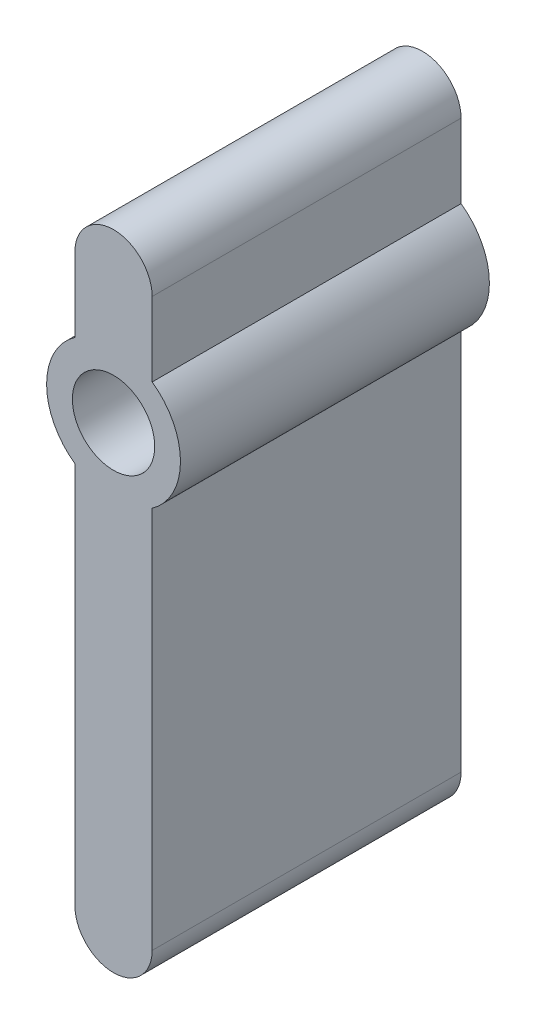
ISO-10303-21;
HEADER;
FILE_DESCRIPTION(('STEP AP214'),'2;1');
FILE_NAME('part.step','',(''),(''),'','','');
FILE_SCHEMA(('AUTOMOTIVE_DESIGN { 1 0 10303 214 1 1 1 1 }'));
ENDSEC;
DATA;
#1=APPLICATION_CONTEXT('core data for automotive mechanical design processes');
#2=APPLICATION_PROTOCOL_DEFINITION('international standard','automotive_design',2000,#1);
#3=PRODUCT_CONTEXT('',#1,'mechanical');
#4=PRODUCT('Part','Part','',(#3));
#5=PRODUCT_RELATED_PRODUCT_CATEGORY('part','',(#4));
#6=PRODUCT_DEFINITION_FORMATION('','',#4);
#7=PRODUCT_DEFINITION_CONTEXT('part definition',#1,'design');
#8=PRODUCT_DEFINITION('design','',#6,#7);
#9=PRODUCT_DEFINITION_SHAPE('','',#8);
#10=(LENGTH_UNIT() NAMED_UNIT(*) SI_UNIT(.MILLI.,.METRE.));
#11=(NAMED_UNIT(*) PLANE_ANGLE_UNIT() SI_UNIT($,.RADIAN.));
#12=(NAMED_UNIT(*) SI_UNIT($,.STERADIAN.) SOLID_ANGLE_UNIT());
#13=UNCERTAINTY_MEASURE_WITH_UNIT(LENGTH_MEASURE(1.E-05),#10,'distance_accuracy_value','');
#14=(GEOMETRIC_REPRESENTATION_CONTEXT(3) GLOBAL_UNCERTAINTY_ASSIGNED_CONTEXT((#13)) GLOBAL_UNIT_ASSIGNED_CONTEXT((#10,
#11,#12)) REPRESENTATION_CONTEXT('',''));
#15=CARTESIAN_POINT('',(0.,0.,0.));
#16=DIRECTION('',(0.,0.,1.));
#17=DIRECTION('',(1.,0.,0.));
#18=AXIS2_PLACEMENT_3D('',#15,#16,#17);
#19=CARTESIAN_POINT('',(1.5,0.,12.));
#20=DIRECTION('',(1.,0.,0.));
#21=DIRECTION('',(0.,1.,0.));
#22=AXIS2_PLACEMENT_3D('',#19,#20,#21);
#23=PLANE('',#22);
#24=DIRECTION('',(0.,-1.,0.));
#25=VECTOR('',#24,1.);
#26=CARTESIAN_POINT('',(1.5,0.,0.));
#27=LINE('',#26,#25);
#28=CARTESIAN_POINT('',(1.5,-2.12367605815953,0.));
#29=VERTEX_POINT('',#28);
#30=CARTESIAN_POINT('',(1.5,-17.,0.));
#31=VERTEX_POINT('',#30);
#32=EDGE_CURVE('E152',#29,#31,#27,.T.);
#33=ORIENTED_EDGE('',*,*,#32,.F.);
#34=DIRECTION('',(0.,0.,-1.));
#35=VECTOR('',#34,1.);
#36=CARTESIAN_POINT('',(1.5,-2.12367605815953,12.));
#37=LINE('',#36,#35);
#38=CARTESIAN_POINT('',(1.5,-2.12367605815953,12.));
#39=VERTEX_POINT('',#38);
#40=EDGE_CURVE('E11',#39,#29,#37,.T.);
#41=ORIENTED_EDGE('',*,*,#40,.F.);
#42=DIRECTION('',(0.,-1.,0.));
#43=VECTOR('',#42,1.);
#44=CARTESIAN_POINT('',(1.5,0.,12.));
#45=LINE('',#44,#43);
#46=CARTESIAN_POINT('',(1.5,-17.,12.));
#47=VERTEX_POINT('',#46);
#48=EDGE_CURVE('E207',#39,#47,#45,.T.);
#49=ORIENTED_EDGE('',*,*,#48,.T.);
#50=DIRECTION('',(0.,0.,-1.));
#51=VECTOR('',#50,1.);
#52=CARTESIAN_POINT('',(1.5,-17.,12.));
#53=LINE('',#52,#51);
#54=EDGE_CURVE('E88',#47,#31,#53,.T.);
#55=ORIENTED_EDGE('',*,*,#54,.T.);
#56=EDGE_LOOP('',(#33,#41,#49,#55));
#57=FACE_BOUND('',#56,.T.);
#58=ADVANCED_FACE('F37',(#57),#23,.T.);
#59=CARTESIAN_POINT('',(0.,0.,12.));
#60=DIRECTION('',(0.,0.,-1.));
#61=DIRECTION('',(-1.,0.,0.));
#62=AXIS2_PLACEMENT_3D('',#59,#60,#61);
#63=CYLINDRICAL_SURFACE('',#62,2.6);
#64=CARTESIAN_POINT('',(0.,0.,0.));
#65=DIRECTION('',(0.,0.,1.));
#66=DIRECTION('',(1.,0.,0.));
#67=AXIS2_PLACEMENT_3D('',#64,#65,#66);
#68=CIRCLE('',#67,2.6);
#69=CARTESIAN_POINT('',(1.5,2.12367605815953,0.));
#70=VERTEX_POINT('',#69);
#71=EDGE_CURVE('E150',#29,#70,#68,.T.);
#72=ORIENTED_EDGE('',*,*,#71,.T.);
#73=DIRECTION('',(0.,0.,-1.));
#74=VECTOR('',#73,1.);
#75=CARTESIAN_POINT('',(1.5,2.12367605815953,12.));
#76=LINE('',#75,#74);
#77=CARTESIAN_POINT('',(1.5,2.12367605815953,12.));
#78=VERTEX_POINT('',#77);
#79=EDGE_CURVE('E46',#78,#70,#76,.T.);
#80=ORIENTED_EDGE('',*,*,#79,.F.);
#81=CARTESIAN_POINT('',(0.,0.,12.));
#82=DIRECTION('',(0.,0.,1.));
#83=DIRECTION('',(1.,0.,0.));
#84=AXIS2_PLACEMENT_3D('',#81,#82,#83);
#85=CIRCLE('',#84,2.6);
#86=EDGE_CURVE('E209',#39,#78,#85,.T.);
#87=ORIENTED_EDGE('',*,*,#86,.F.);
#88=ORIENTED_EDGE('',*,*,#40,.T.);
#89=EDGE_LOOP('',(#72,#80,#87,#88));
#90=FACE_BOUND('',#89,.T.);
#91=ADVANCED_FACE('F151',(#90),#63,.T.);
#92=CARTESIAN_POINT('',(1.5,0.,12.));
#93=DIRECTION('',(1.,0.,0.));
#94=DIRECTION('',(0.,1.,0.));
#95=AXIS2_PLACEMENT_3D('',#92,#93,#94);
#96=PLANE('',#95);
#97=DIRECTION('',(0.,-1.,0.));
#98=VECTOR('',#97,1.);
#99=CARTESIAN_POINT('',(1.5,0.,0.));
#100=LINE('',#99,#98);
#101=CARTESIAN_POINT('',(1.5,5.,0.));
#102=VERTEX_POINT('',#101);
#103=EDGE_CURVE('E145',#102,#70,#100,.T.);
#104=ORIENTED_EDGE('',*,*,#103,.F.);
#105=DIRECTION('',(0.,0.,-1.));
#106=VECTOR('',#105,1.);
#107=CARTESIAN_POINT('',(1.5,5.,12.));
#108=LINE('',#107,#106);
#109=CARTESIAN_POINT('',(1.5,5.,12.));
#110=VERTEX_POINT('',#109);
#111=EDGE_CURVE('E137',#110,#102,#108,.T.);
#112=ORIENTED_EDGE('',*,*,#111,.F.);
#113=DIRECTION('',(0.,-1.,0.));
#114=VECTOR('',#113,1.);
#115=CARTESIAN_POINT('',(1.5,0.,12.));
#116=LINE('',#115,#114);
#117=EDGE_CURVE('E147',#110,#78,#116,.T.);
#118=ORIENTED_EDGE('',*,*,#117,.T.);
#119=ORIENTED_EDGE('',*,*,#79,.T.);
#120=EDGE_LOOP('',(#104,#112,#118,#119));
#121=FACE_BOUND('',#120,.T.);
#122=ADVANCED_FACE('F143',(#121),#96,.T.);
#123=CARTESIAN_POINT('',(0.,5.,12.));
#124=DIRECTION('',(0.,0.,-1.));
#125=DIRECTION('',(-1.,0.,0.));
#126=AXIS2_PLACEMENT_3D('',#123,#124,#125);
#127=CYLINDRICAL_SURFACE('',#126,1.5);
#128=CARTESIAN_POINT('',(0.,5.,0.));
#129=DIRECTION('',(0.,0.,1.));
#130=DIRECTION('',(1.,0.,0.));
#131=AXIS2_PLACEMENT_3D('',#128,#129,#130);
#132=CIRCLE('',#131,1.5);
#133=CARTESIAN_POINT('',(-1.5,5.,0.));
#134=VERTEX_POINT('',#133);
#135=EDGE_CURVE('E157',#102,#134,#132,.T.);
#136=ORIENTED_EDGE('',*,*,#135,.T.);
#137=DIRECTION('',(0.,0.,-1.));
#138=VECTOR('',#137,1.);
#139=CARTESIAN_POINT('',(-1.5,5.,12.));
#140=LINE('',#139,#138);
#141=CARTESIAN_POINT('',(-1.5,5.,12.));
#142=VERTEX_POINT('',#141);
#143=EDGE_CURVE('E130',#142,#134,#140,.T.);
#144=ORIENTED_EDGE('',*,*,#143,.F.);
#145=CARTESIAN_POINT('',(0.,5.,12.));
#146=DIRECTION('',(0.,0.,1.));
#147=DIRECTION('',(1.,0.,0.));
#148=AXIS2_PLACEMENT_3D('',#145,#146,#147);
#149=CIRCLE('',#148,1.5);
#150=EDGE_CURVE('E214',#110,#142,#149,.T.);
#151=ORIENTED_EDGE('',*,*,#150,.F.);
#152=ORIENTED_EDGE('',*,*,#111,.T.);
#153=EDGE_LOOP('',(#136,#144,#151,#152));
#154=FACE_BOUND('',#153,.T.);
#155=ADVANCED_FACE('F181',(#154),#127,.T.);
#156=CARTESIAN_POINT('',(-1.5,0.,12.));
#157=DIRECTION('',(1.,0.,0.));
#158=DIRECTION('',(0.,1.,0.));
#159=AXIS2_PLACEMENT_3D('',#156,#157,#158);
#160=PLANE('',#159);
#161=DIRECTION('',(0.,-1.,0.));
#162=VECTOR('',#161,1.);
#163=CARTESIAN_POINT('',(-1.5,0.,0.));
#164=LINE('',#163,#162);
#165=CARTESIAN_POINT('',(-1.5,2.12367605815953,0.));
#166=VERTEX_POINT('',#165);
#167=EDGE_CURVE('E159',#134,#166,#164,.T.);
#168=ORIENTED_EDGE('',*,*,#167,.T.);
#169=DIRECTION('',(0.,0.,-1.));
#170=VECTOR('',#169,1.);
#171=CARTESIAN_POINT('',(-1.5,2.12367605815953,12.));
#172=LINE('',#171,#170);
#173=CARTESIAN_POINT('',(-1.5,2.12367605815953,12.));
#174=VERTEX_POINT('',#173);
#175=EDGE_CURVE('E128',#174,#166,#172,.T.);
#176=ORIENTED_EDGE('',*,*,#175,.F.);
#177=DIRECTION('',(0.,-1.,0.));
#178=VECTOR('',#177,1.);
#179=CARTESIAN_POINT('',(-1.5,0.,12.));
#180=LINE('',#179,#178);
#181=EDGE_CURVE('E121',#142,#174,#180,.T.);
#182=ORIENTED_EDGE('',*,*,#181,.F.);
#183=ORIENTED_EDGE('',*,*,#143,.T.);
#184=EDGE_LOOP('',(#168,#176,#182,#183));
#185=FACE_BOUND('',#184,.T.);
#186=ADVANCED_FACE('F184',(#185),#160,.F.);
#187=CARTESIAN_POINT('',(0.,0.,12.));
#188=DIRECTION('',(0.,0.,-1.));
#189=DIRECTION('',(-1.,0.,0.));
#190=AXIS2_PLACEMENT_3D('',#187,#188,#189);
#191=CYLINDRICAL_SURFACE('',#190,2.6);
#192=CARTESIAN_POINT('',(0.,0.,0.));
#193=DIRECTION('',(0.,0.,1.));
#194=DIRECTION('',(1.,0.,0.));
#195=AXIS2_PLACEMENT_3D('',#192,#193,#194);
#196=CIRCLE('',#195,2.6);
#197=CARTESIAN_POINT('',(-1.5,-2.12367605815953,0.));
#198=VERTEX_POINT('',#197);
#199=EDGE_CURVE('E127',#166,#198,#196,.T.);
#200=ORIENTED_EDGE('',*,*,#199,.T.);
#201=DIRECTION('',(0.,0.,-1.));
#202=VECTOR('',#201,1.);
#203=CARTESIAN_POINT('',(-1.5,-2.12367605815953,12.));
#204=LINE('',#203,#202);
#205=CARTESIAN_POINT('',(-1.5,-2.12367605815953,12.));
#206=VERTEX_POINT('',#205);
#207=EDGE_CURVE('E113',#206,#198,#204,.T.);
#208=ORIENTED_EDGE('',*,*,#207,.F.);
#209=CARTESIAN_POINT('',(0.,0.,12.));
#210=DIRECTION('',(0.,0.,1.));
#211=DIRECTION('',(1.,0.,0.));
#212=AXIS2_PLACEMENT_3D('',#209,#210,#211);
#213=CIRCLE('',#212,2.6);
#214=EDGE_CURVE('E116',#174,#206,#213,.T.);
#215=ORIENTED_EDGE('',*,*,#214,.F.);
#216=ORIENTED_EDGE('',*,*,#175,.T.);
#217=EDGE_LOOP('',(#200,#208,#215,#216));
#218=FACE_BOUND('',#217,.T.);
#219=ADVANCED_FACE('F126',(#218),#191,.T.);
#220=CARTESIAN_POINT('',(-1.5,0.,12.));
#221=DIRECTION('',(1.,0.,0.));
#222=DIRECTION('',(0.,1.,0.));
#223=AXIS2_PLACEMENT_3D('',#220,#221,#222);
#224=PLANE('',#223);
#225=DIRECTION('',(0.,-1.,0.));
#226=VECTOR('',#225,1.);
#227=CARTESIAN_POINT('',(-1.5,0.,0.));
#228=LINE('',#227,#226);
#229=CARTESIAN_POINT('',(-1.5,-17.,0.));
#230=VERTEX_POINT('',#229);
#231=EDGE_CURVE('E166',#198,#230,#228,.T.);
#232=ORIENTED_EDGE('',*,*,#231,.T.);
#233=DIRECTION('',(0.,0.,-1.));
#234=VECTOR('',#233,1.);
#235=CARTESIAN_POINT('',(-1.5,-17.,12.));
#236=LINE('',#235,#234);
#237=CARTESIAN_POINT('',(-1.5,-17.,12.));
#238=VERTEX_POINT('',#237);
#239=EDGE_CURVE('E115',#238,#230,#236,.T.);
#240=ORIENTED_EDGE('',*,*,#239,.F.);
#241=DIRECTION('',(0.,-1.,0.));
#242=VECTOR('',#241,1.);
#243=CARTESIAN_POINT('',(-1.5,0.,12.));
#244=LINE('',#243,#242);
#245=EDGE_CURVE('E108',#206,#238,#244,.T.);
#246=ORIENTED_EDGE('',*,*,#245,.F.);
#247=ORIENTED_EDGE('',*,*,#207,.T.);
#248=EDGE_LOOP('',(#232,#240,#246,#247));
#249=FACE_BOUND('',#248,.T.);
#250=ADVANCED_FACE('F111',(#249),#224,.F.);
#251=CARTESIAN_POINT('',(0.,0.,12.));
#252=DIRECTION('',(0.,0.,-1.));
#253=DIRECTION('',(-1.,0.,0.));
#254=AXIS2_PLACEMENT_3D('',#251,#252,#253);
#255=CYLINDRICAL_SURFACE('',#254,1.60000000000001);
#256=CARTESIAN_POINT('',(0.,0.,12.));
#257=DIRECTION('',(0.,0.,1.));
#258=DIRECTION('',(1.,0.,0.));
#259=AXIS2_PLACEMENT_3D('',#256,#257,#258);
#260=CIRCLE('',#259,1.60000000000001);
#261=CARTESIAN_POINT('',(1.60000000000001,0.,12.));
#262=VERTEX_POINT('',#261);
#263=EDGE_CURVE('E168',#262,#262,#260,.T.);
#264=ORIENTED_EDGE('',*,*,#263,.T.);
#265=EDGE_LOOP('',(#264));
#266=FACE_BOUND('',#265,.T.);
#267=CARTESIAN_POINT('',(0.,0.,0.));
#268=DIRECTION('',(0.,0.,1.));
#269=DIRECTION('',(1.,0.,0.));
#270=AXIS2_PLACEMENT_3D('',#267,#268,#269);
#271=CIRCLE('',#270,1.60000000000001);
#272=CARTESIAN_POINT('',(1.60000000000001,0.,0.));
#273=VERTEX_POINT('',#272);
#274=EDGE_CURVE('E171',#273,#273,#271,.T.);
#275=ORIENTED_EDGE('',*,*,#274,.F.);
#276=EDGE_LOOP('',(#275));
#277=FACE_BOUND('',#276,.T.);
#278=ADVANCED_FACE('F39',(#266,#277),#255,.F.);
#279=CARTESIAN_POINT('',(0.,-17.,12.));
#280=DIRECTION('',(0.,0.,-1.));
#281=DIRECTION('',(-1.,0.,0.));
#282=AXIS2_PLACEMENT_3D('',#279,#280,#281);
#283=CYLINDRICAL_SURFACE('',#282,1.5);
#284=CARTESIAN_POINT('',(0.,-17.,0.));
#285=DIRECTION('',(0.,0.,1.));
#286=DIRECTION('',(1.,0.,0.));
#287=AXIS2_PLACEMENT_3D('',#284,#285,#286);
#288=CIRCLE('',#287,1.5);
#289=EDGE_CURVE('E81',#230,#31,#288,.T.);
#290=ORIENTED_EDGE('',*,*,#289,.T.);
#291=ORIENTED_EDGE('',*,*,#54,.F.);
#292=CARTESIAN_POINT('',(0.,-17.,12.));
#293=DIRECTION('',(0.,0.,1.));
#294=DIRECTION('',(1.,0.,0.));
#295=AXIS2_PLACEMENT_3D('',#292,#293,#294);
#296=CIRCLE('',#295,1.5);
#297=EDGE_CURVE('E54',#238,#47,#296,.T.);
#298=ORIENTED_EDGE('',*,*,#297,.F.);
#299=ORIENTED_EDGE('',*,*,#239,.T.);
#300=EDGE_LOOP('',(#290,#291,#298,#299));
#301=FACE_BOUND('',#300,.T.);
#302=ADVANCED_FACE('F193',(#301),#283,.T.);
#303=CARTESIAN_POINT('',(0.,0.,12.));
#304=DIRECTION('',(0.,0.,1.));
#305=DIRECTION('',(1.,0.,0.));
#306=AXIS2_PLACEMENT_3D('',#303,#304,#305);
#307=PLANE('',#306);
#308=ORIENTED_EDGE('',*,*,#263,.F.);
#309=EDGE_LOOP('',(#308));
#310=FACE_BOUND('',#309,.T.);
#311=ORIENTED_EDGE('',*,*,#48,.F.);
#312=ORIENTED_EDGE('',*,*,#86,.T.);
#313=ORIENTED_EDGE('',*,*,#117,.F.);
#314=ORIENTED_EDGE('',*,*,#150,.T.);
#315=ORIENTED_EDGE('',*,*,#181,.T.);
#316=ORIENTED_EDGE('',*,*,#214,.T.);
#317=ORIENTED_EDGE('',*,*,#245,.T.);
#318=ORIENTED_EDGE('',*,*,#297,.T.);
#319=EDGE_LOOP('',(#311,#312,#313,#314,#315,#316,#317,#318));
#320=FACE_BOUND('',#319,.T.);
#321=ADVANCED_FACE('F119',(#310,#320),#307,.T.);
#322=CARTESIAN_POINT('',(0.,0.,0.));
#323=DIRECTION('',(0.,0.,1.));
#324=DIRECTION('',(1.,0.,0.));
#325=AXIS2_PLACEMENT_3D('',#322,#323,#324);
#326=PLANE('',#325);
#327=ORIENTED_EDGE('',*,*,#274,.T.);
#328=EDGE_LOOP('',(#327));
#329=FACE_BOUND('',#328,.T.);
#330=ORIENTED_EDGE('',*,*,#32,.T.);
#331=ORIENTED_EDGE('',*,*,#289,.F.);
#332=ORIENTED_EDGE('',*,*,#231,.F.);
#333=ORIENTED_EDGE('',*,*,#199,.F.);
#334=ORIENTED_EDGE('',*,*,#167,.F.);
#335=ORIENTED_EDGE('',*,*,#135,.F.);
#336=ORIENTED_EDGE('',*,*,#103,.T.);
#337=ORIENTED_EDGE('',*,*,#71,.F.);
#338=EDGE_LOOP('',(#330,#331,#332,#333,#334,#335,#336,#337));
#339=FACE_BOUND('',#338,.T.);
#340=ADVANCED_FACE('F155',(#329,#339),#326,.F.);
#341=CLOSED_SHELL('',(#58,#91,#122,#155,#186,#219,#250,#278,#302,#321,#340));
#342=MANIFOLD_SOLID_BREP('B2',#341);
#343=ADVANCED_BREP_SHAPE_REPRESENTATION('',(#18,#342),#14);
#344=SHAPE_DEFINITION_REPRESENTATION(#9,#343);
ENDSEC;
END-ISO-10303-21;
